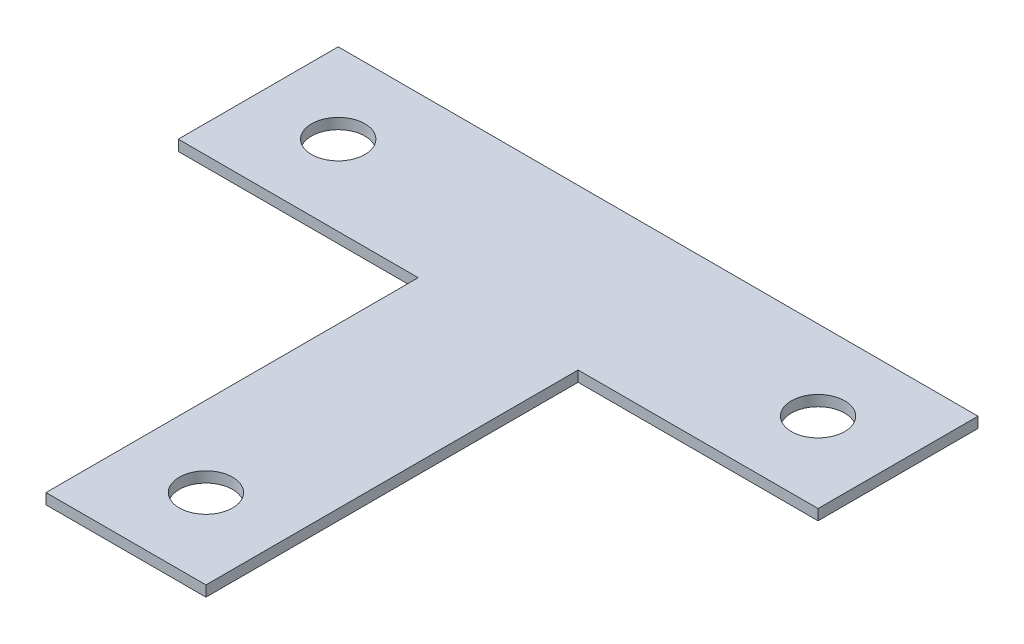
ISO-10303-21;
HEADER;
FILE_DESCRIPTION(('STEP AP214'),'2;1');
FILE_NAME('part.step','',(''),(''),'','','');
FILE_SCHEMA(('AUTOMOTIVE_DESIGN { 1 0 10303 214 1 1 1 1 }'));
ENDSEC;
DATA;
#1=APPLICATION_CONTEXT('core data for automotive mechanical design processes');
#2=APPLICATION_PROTOCOL_DEFINITION('international standard','automotive_design',2000,#1);
#3=PRODUCT_CONTEXT('',#1,'mechanical');
#4=PRODUCT('Part','Part','',(#3));
#5=PRODUCT_RELATED_PRODUCT_CATEGORY('part','',(#4));
#6=PRODUCT_DEFINITION_FORMATION('','',#4);
#7=PRODUCT_DEFINITION_CONTEXT('part definition',#1,'design');
#8=PRODUCT_DEFINITION('design','',#6,#7);
#9=PRODUCT_DEFINITION_SHAPE('','',#8);
#10=(LENGTH_UNIT() NAMED_UNIT(*) SI_UNIT(.MILLI.,.METRE.));
#11=(NAMED_UNIT(*) PLANE_ANGLE_UNIT() SI_UNIT($,.RADIAN.));
#12=(NAMED_UNIT(*) SI_UNIT($,.STERADIAN.) SOLID_ANGLE_UNIT());
#13=UNCERTAINTY_MEASURE_WITH_UNIT(LENGTH_MEASURE(1.E-05),#10,'distance_accuracy_value','');
#14=(GEOMETRIC_REPRESENTATION_CONTEXT(3) GLOBAL_UNCERTAINTY_ASSIGNED_CONTEXT((#13)) GLOBAL_UNIT_ASSIGNED_CONTEXT((#10,
#11,#12)) REPRESENTATION_CONTEXT('',''));
#15=CARTESIAN_POINT('',(0.,0.,0.));
#16=DIRECTION('',(0.,0.,1.));
#17=DIRECTION('',(1.,0.,0.));
#18=AXIS2_PLACEMENT_3D('',#15,#16,#17);
#19=CARTESIAN_POINT('',(0.,2.54,0.));
#20=DIRECTION('',(0.,1.,0.));
#21=DIRECTION('',(0.,0.,1.));
#22=AXIS2_PLACEMENT_3D('',#19,#20,#21);
#23=PLANE('',#22);
#24=CARTESIAN_POINT('',(-57.15,2.54,-44.2080948978361));
#25=DIRECTION('',(0.,1.,0.));
#26=DIRECTION('',(0.,0.,1.));
#27=AXIS2_PLACEMENT_3D('',#24,#25,#26);
#28=CIRCLE('',#27,6.35);
#29=CARTESIAN_POINT('',(-57.15,2.54,-37.8580948978361));
#30=VERTEX_POINT('',#29);
#31=EDGE_CURVE('E182',#30,#30,#28,.T.);
#32=ORIENTED_EDGE('',*,*,#31,.F.);
#33=EDGE_LOOP('',(#32));
#34=FACE_BOUND('',#33,.T.);
#35=DIRECTION('',(1.,0.,0.));
#36=VECTOR('',#35,1.);
#37=CARTESIAN_POINT('',(19.05,2.54,-25.1580948978361));
#38=LINE('',#37,#36);
#39=CARTESIAN_POINT('',(19.05,2.54,-25.1580948978361));
#40=VERTEX_POINT('',#39);
#41=CARTESIAN_POINT('',(76.2,2.54,-25.1580948978361));
#42=VERTEX_POINT('',#41);
#43=EDGE_CURVE('E145',#40,#42,#38,.T.);
#44=ORIENTED_EDGE('',*,*,#43,.T.);
#45=DIRECTION('',(0.,0.,-1.));
#46=VECTOR('',#45,1.);
#47=CARTESIAN_POINT('',(76.2,2.54,-25.1580948978361));
#48=LINE('',#47,#46);
#49=CARTESIAN_POINT('',(76.2,2.54,-63.2580948978361));
#50=VERTEX_POINT('',#49);
#51=EDGE_CURVE('E93',#42,#50,#48,.T.);
#52=ORIENTED_EDGE('',*,*,#51,.T.);
#53=DIRECTION('',(-1.,0.,0.));
#54=VECTOR('',#53,1.);
#55=CARTESIAN_POINT('',(76.2,2.54,-63.2580948978361));
#56=LINE('',#55,#54);
#57=CARTESIAN_POINT('',(-76.2,2.54,-63.2580948978361));
#58=VERTEX_POINT('',#57);
#59=EDGE_CURVE('E160',#50,#58,#56,.T.);
#60=ORIENTED_EDGE('',*,*,#59,.T.);
#61=DIRECTION('',(0.,0.,1.));
#62=VECTOR('',#61,1.);
#63=CARTESIAN_POINT('',(-76.2,2.54,-63.2580948978361));
#64=LINE('',#63,#62);
#65=CARTESIAN_POINT('',(-76.2,2.54,-25.1580948978361));
#66=VERTEX_POINT('',#65);
#67=EDGE_CURVE('E173',#58,#66,#64,.T.);
#68=ORIENTED_EDGE('',*,*,#67,.T.);
#69=DIRECTION('',(1.,0.,0.));
#70=VECTOR('',#69,1.);
#71=CARTESIAN_POINT('',(-76.2,2.54,-25.1580948978361));
#72=LINE('',#71,#70);
#73=CARTESIAN_POINT('',(-19.05,2.54,-25.1580948978361));
#74=VERTEX_POINT('',#73);
#75=EDGE_CURVE('E112',#66,#74,#72,.T.);
#76=ORIENTED_EDGE('',*,*,#75,.T.);
#77=DIRECTION('',(0.,0.,1.));
#78=VECTOR('',#77,1.);
#79=CARTESIAN_POINT('',(-19.05,2.54,-25.1580948978361));
#80=LINE('',#79,#78);
#81=CARTESIAN_POINT('',(-19.05,2.54,63.5));
#82=VERTEX_POINT('',#81);
#83=EDGE_CURVE('E106',#74,#82,#80,.T.);
#84=ORIENTED_EDGE('',*,*,#83,.T.);
#85=DIRECTION('',(1.,0.,0.));
#86=VECTOR('',#85,1.);
#87=CARTESIAN_POINT('',(-19.05,2.54,63.5));
#88=LINE('',#87,#86);
#89=CARTESIAN_POINT('',(19.05,2.54,63.5));
#90=VERTEX_POINT('',#89);
#91=EDGE_CURVE('E110',#82,#90,#88,.T.);
#92=ORIENTED_EDGE('',*,*,#91,.T.);
#93=DIRECTION('',(0.,0.,-1.));
#94=VECTOR('',#93,1.);
#95=CARTESIAN_POINT('',(19.05,2.54,63.5));
#96=LINE('',#95,#94);
#97=EDGE_CURVE('E50',#90,#40,#96,.T.);
#98=ORIENTED_EDGE('',*,*,#97,.T.);
#99=EDGE_LOOP('',(#44,#52,#60,#68,#76,#84,#92,#98));
#100=FACE_BOUND('',#99,.T.);
#101=CARTESIAN_POINT('',(0.,2.54,44.45));
#102=DIRECTION('',(0.,1.,0.));
#103=DIRECTION('',(0.,0.,1.));
#104=AXIS2_PLACEMENT_3D('',#101,#102,#103);
#105=CIRCLE('',#104,6.35);
#106=CARTESIAN_POINT('',(0.,2.54,50.8));
#107=VERTEX_POINT('',#106);
#108=EDGE_CURVE('E134',#107,#107,#105,.T.);
#109=ORIENTED_EDGE('',*,*,#108,.F.);
#110=EDGE_LOOP('',(#109));
#111=FACE_BOUND('',#110,.T.);
#112=CARTESIAN_POINT('',(57.15,2.54,-44.2080948978361));
#113=DIRECTION('',(0.,1.,0.));
#114=DIRECTION('',(0.,0.,1.));
#115=AXIS2_PLACEMENT_3D('',#112,#113,#114);
#116=CIRCLE('',#115,6.35);
#117=CARTESIAN_POINT('',(57.15,2.54,-37.8580948978361));
#118=VERTEX_POINT('',#117);
#119=EDGE_CURVE('E188',#118,#118,#116,.T.);
#120=ORIENTED_EDGE('',*,*,#119,.F.);
#121=EDGE_LOOP('',(#120));
#122=FACE_BOUND('',#121,.T.);
#123=ADVANCED_FACE('F33',(#34,#100,#111,#122),#23,.T.);
#124=CARTESIAN_POINT('',(0.,0.,0.));
#125=DIRECTION('',(0.,1.,0.));
#126=DIRECTION('',(0.,0.,1.));
#127=AXIS2_PLACEMENT_3D('',#124,#125,#126);
#128=PLANE('',#127);
#129=DIRECTION('',(1.,0.,0.));
#130=VECTOR('',#129,1.);
#131=CARTESIAN_POINT('',(19.05,0.,-25.1580948978361));
#132=LINE('',#131,#130);
#133=CARTESIAN_POINT('',(19.05,0.,-25.1580948978361));
#134=VERTEX_POINT('',#133);
#135=CARTESIAN_POINT('',(76.2,0.,-25.1580948978361));
#136=VERTEX_POINT('',#135);
#137=EDGE_CURVE('E130',#134,#136,#132,.T.);
#138=ORIENTED_EDGE('',*,*,#137,.F.);
#139=DIRECTION('',(0.,0.,-1.));
#140=VECTOR('',#139,1.);
#141=CARTESIAN_POINT('',(19.05,0.,63.5));
#142=LINE('',#141,#140);
#143=CARTESIAN_POINT('',(19.05,0.,63.5));
#144=VERTEX_POINT('',#143);
#145=EDGE_CURVE('E85',#144,#134,#142,.T.);
#146=ORIENTED_EDGE('',*,*,#145,.F.);
#147=DIRECTION('',(1.,0.,0.));
#148=VECTOR('',#147,1.);
#149=CARTESIAN_POINT('',(-19.05,0.,63.5));
#150=LINE('',#149,#148);
#151=CARTESIAN_POINT('',(-19.05,0.,63.5));
#152=VERTEX_POINT('',#151);
#153=EDGE_CURVE('E79',#152,#144,#150,.T.);
#154=ORIENTED_EDGE('',*,*,#153,.F.);
#155=DIRECTION('',(0.,0.,1.));
#156=VECTOR('',#155,1.);
#157=CARTESIAN_POINT('',(-19.05,0.,-25.1580948978361));
#158=LINE('',#157,#156);
#159=CARTESIAN_POINT('',(-19.05,0.,-25.1580948978361));
#160=VERTEX_POINT('',#159);
#161=EDGE_CURVE('E120',#160,#152,#158,.T.);
#162=ORIENTED_EDGE('',*,*,#161,.F.);
#163=DIRECTION('',(1.,0.,0.));
#164=VECTOR('',#163,1.);
#165=CARTESIAN_POINT('',(-76.2,0.,-25.1580948978361));
#166=LINE('',#165,#164);
#167=CARTESIAN_POINT('',(-76.2,0.,-25.1580948978361));
#168=VERTEX_POINT('',#167);
#169=EDGE_CURVE('E140',#168,#160,#166,.T.);
#170=ORIENTED_EDGE('',*,*,#169,.F.);
#171=DIRECTION('',(0.,0.,1.));
#172=VECTOR('',#171,1.);
#173=CARTESIAN_POINT('',(-76.2,0.,-63.2580948978361));
#174=LINE('',#173,#172);
#175=CARTESIAN_POINT('',(-76.2,0.,-63.2580948978361));
#176=VERTEX_POINT('',#175);
#177=EDGE_CURVE('E138',#176,#168,#174,.T.);
#178=ORIENTED_EDGE('',*,*,#177,.F.);
#179=DIRECTION('',(-1.,0.,0.));
#180=VECTOR('',#179,1.);
#181=CARTESIAN_POINT('',(76.2,0.,-63.2580948978361));
#182=LINE('',#181,#180);
#183=CARTESIAN_POINT('',(76.2,0.,-63.2580948978361));
#184=VERTEX_POINT('',#183);
#185=EDGE_CURVE('E136',#184,#176,#182,.T.);
#186=ORIENTED_EDGE('',*,*,#185,.F.);
#187=DIRECTION('',(0.,0.,-1.));
#188=VECTOR('',#187,1.);
#189=CARTESIAN_POINT('',(76.2,0.,-25.1580948978361));
#190=LINE('',#189,#188);
#191=EDGE_CURVE('E133',#136,#184,#190,.T.);
#192=ORIENTED_EDGE('',*,*,#191,.F.);
#193=EDGE_LOOP('',(#138,#146,#154,#162,#170,#178,#186,#192));
#194=FACE_BOUND('',#193,.T.);
#195=CARTESIAN_POINT('',(0.,0.,44.45));
#196=DIRECTION('',(0.,1.,0.));
#197=DIRECTION('',(0.,0.,1.));
#198=AXIS2_PLACEMENT_3D('',#195,#196,#197);
#199=CIRCLE('',#198,6.35);
#200=CARTESIAN_POINT('',(0.,0.,50.8));
#201=VERTEX_POINT('',#200);
#202=EDGE_CURVE('E179',#201,#201,#199,.T.);
#203=ORIENTED_EDGE('',*,*,#202,.T.);
#204=EDGE_LOOP('',(#203));
#205=FACE_BOUND('',#204,.T.);
#206=CARTESIAN_POINT('',(-57.15,0.,-44.2080948978361));
#207=DIRECTION('',(0.,1.,0.));
#208=DIRECTION('',(0.,0.,1.));
#209=AXIS2_PLACEMENT_3D('',#206,#207,#208);
#210=CIRCLE('',#209,6.35);
#211=CARTESIAN_POINT('',(-57.15,0.,-37.8580948978361));
#212=VERTEX_POINT('',#211);
#213=EDGE_CURVE('E185',#212,#212,#210,.T.);
#214=ORIENTED_EDGE('',*,*,#213,.T.);
#215=EDGE_LOOP('',(#214));
#216=FACE_BOUND('',#215,.T.);
#217=CARTESIAN_POINT('',(57.15,0.,-44.2080948978361));
#218=DIRECTION('',(0.,1.,0.));
#219=DIRECTION('',(0.,0.,1.));
#220=AXIS2_PLACEMENT_3D('',#217,#218,#219);
#221=CIRCLE('',#220,6.35);
#222=CARTESIAN_POINT('',(57.15,0.,-37.8580948978361));
#223=VERTEX_POINT('',#222);
#224=EDGE_CURVE('E191',#223,#223,#221,.T.);
#225=ORIENTED_EDGE('',*,*,#224,.T.);
#226=EDGE_LOOP('',(#225));
#227=FACE_BOUND('',#226,.T.);
#228=ADVANCED_FACE('F164',(#194,#205,#216,#227),#128,.F.);
#229=CARTESIAN_POINT('',(19.05,2.54,-25.1580948978361));
#230=DIRECTION('',(0.,0.,-1.));
#231=DIRECTION('',(-1.,0.,0.));
#232=AXIS2_PLACEMENT_3D('',#229,#230,#231);
#233=PLANE('',#232);
#234=ORIENTED_EDGE('',*,*,#137,.T.);
#235=DIRECTION('',(0.,-1.,0.));
#236=VECTOR('',#235,1.);
#237=CARTESIAN_POINT('',(76.2,2.54,-25.1580948978361));
#238=LINE('',#237,#236);
#239=EDGE_CURVE('E11',#42,#136,#238,.T.);
#240=ORIENTED_EDGE('',*,*,#239,.F.);
#241=ORIENTED_EDGE('',*,*,#43,.F.);
#242=DIRECTION('',(0.,-1.,0.));
#243=VECTOR('',#242,1.);
#244=CARTESIAN_POINT('',(19.05,2.54,-25.1580948978361));
#245=LINE('',#244,#243);
#246=EDGE_CURVE('E126',#40,#134,#245,.T.);
#247=ORIENTED_EDGE('',*,*,#246,.T.);
#248=EDGE_LOOP('',(#234,#240,#241,#247));
#249=FACE_BOUND('',#248,.T.);
#250=ADVANCED_FACE('F35',(#249),#233,.F.);
#251=CARTESIAN_POINT('',(76.2,2.54,-25.1580948978361));
#252=DIRECTION('',(-1.,0.,0.));
#253=DIRECTION('',(0.,0.,1.));
#254=AXIS2_PLACEMENT_3D('',#251,#252,#253);
#255=PLANE('',#254);
#256=ORIENTED_EDGE('',*,*,#191,.T.);
#257=DIRECTION('',(0.,-1.,0.));
#258=VECTOR('',#257,1.);
#259=CARTESIAN_POINT('',(76.2,2.54,-63.2580948978361));
#260=LINE('',#259,#258);
#261=EDGE_CURVE('E42',#50,#184,#260,.T.);
#262=ORIENTED_EDGE('',*,*,#261,.F.);
#263=ORIENTED_EDGE('',*,*,#51,.F.);
#264=ORIENTED_EDGE('',*,*,#239,.T.);
#265=EDGE_LOOP('',(#256,#262,#263,#264));
#266=FACE_BOUND('',#265,.T.);
#267=ADVANCED_FACE('F224',(#266),#255,.F.);
#268=CARTESIAN_POINT('',(76.2,2.54,-63.2580948978361));
#269=DIRECTION('',(0.,0.,1.));
#270=DIRECTION('',(1.,0.,0.));
#271=AXIS2_PLACEMENT_3D('',#268,#269,#270);
#272=PLANE('',#271);
#273=ORIENTED_EDGE('',*,*,#185,.T.);
#274=DIRECTION('',(0.,-1.,0.));
#275=VECTOR('',#274,1.);
#276=CARTESIAN_POINT('',(-76.2,2.54,-63.2580948978361));
#277=LINE('',#276,#275);
#278=EDGE_CURVE('E152',#58,#176,#277,.T.);
#279=ORIENTED_EDGE('',*,*,#278,.F.);
#280=ORIENTED_EDGE('',*,*,#59,.F.);
#281=ORIENTED_EDGE('',*,*,#261,.T.);
#282=EDGE_LOOP('',(#273,#279,#280,#281));
#283=FACE_BOUND('',#282,.T.);
#284=ADVANCED_FACE('F158',(#283),#272,.F.);
#285=CARTESIAN_POINT('',(-76.2,2.54,-63.2580948978361));
#286=DIRECTION('',(1.,0.,0.));
#287=DIRECTION('',(0.,0.,-1.));
#288=AXIS2_PLACEMENT_3D('',#285,#286,#287);
#289=PLANE('',#288);
#290=ORIENTED_EDGE('',*,*,#177,.T.);
#291=DIRECTION('',(0.,-1.,0.));
#292=VECTOR('',#291,1.);
#293=CARTESIAN_POINT('',(-76.2,2.54,-25.1580948978361));
#294=LINE('',#293,#292);
#295=EDGE_CURVE('E149',#66,#168,#294,.T.);
#296=ORIENTED_EDGE('',*,*,#295,.F.);
#297=ORIENTED_EDGE('',*,*,#67,.F.);
#298=ORIENTED_EDGE('',*,*,#278,.T.);
#299=EDGE_LOOP('',(#290,#296,#297,#298));
#300=FACE_BOUND('',#299,.T.);
#301=ADVANCED_FACE('F169',(#300),#289,.F.);
#302=CARTESIAN_POINT('',(-76.2,2.54,-25.1580948978361));
#303=DIRECTION('',(0.,0.,-1.));
#304=DIRECTION('',(-1.,0.,0.));
#305=AXIS2_PLACEMENT_3D('',#302,#303,#304);
#306=PLANE('',#305);
#307=ORIENTED_EDGE('',*,*,#169,.T.);
#308=DIRECTION('',(0.,-1.,0.));
#309=VECTOR('',#308,1.);
#310=CARTESIAN_POINT('',(-19.05,2.54,-25.1580948978361));
#311=LINE('',#310,#309);
#312=EDGE_CURVE('E121',#74,#160,#311,.T.);
#313=ORIENTED_EDGE('',*,*,#312,.F.);
#314=ORIENTED_EDGE('',*,*,#75,.F.);
#315=ORIENTED_EDGE('',*,*,#295,.T.);
#316=EDGE_LOOP('',(#307,#313,#314,#315));
#317=FACE_BOUND('',#316,.T.);
#318=ADVANCED_FACE('F172',(#317),#306,.F.);
#319=CARTESIAN_POINT('',(-19.05,2.54,-25.1580948978361));
#320=DIRECTION('',(1.,0.,0.));
#321=DIRECTION('',(0.,0.,-1.));
#322=AXIS2_PLACEMENT_3D('',#319,#320,#321);
#323=PLANE('',#322);
#324=ORIENTED_EDGE('',*,*,#161,.T.);
#325=DIRECTION('',(0.,-1.,0.));
#326=VECTOR('',#325,1.);
#327=CARTESIAN_POINT('',(-19.05,2.54,63.5));
#328=LINE('',#327,#326);
#329=EDGE_CURVE('E117',#82,#152,#328,.T.);
#330=ORIENTED_EDGE('',*,*,#329,.F.);
#331=ORIENTED_EDGE('',*,*,#83,.F.);
#332=ORIENTED_EDGE('',*,*,#312,.T.);
#333=EDGE_LOOP('',(#324,#330,#331,#332));
#334=FACE_BOUND('',#333,.T.);
#335=ADVANCED_FACE('F118',(#334),#323,.F.);
#336=CARTESIAN_POINT('',(-19.05,2.54,63.5));
#337=DIRECTION('',(0.,0.,-1.));
#338=DIRECTION('',(-1.,0.,0.));
#339=AXIS2_PLACEMENT_3D('',#336,#337,#338);
#340=PLANE('',#339);
#341=ORIENTED_EDGE('',*,*,#153,.T.);
#342=DIRECTION('',(0.,-1.,0.));
#343=VECTOR('',#342,1.);
#344=CARTESIAN_POINT('',(19.05,2.54,63.5));
#345=LINE('',#344,#343);
#346=EDGE_CURVE('E122',#90,#144,#345,.T.);
#347=ORIENTED_EDGE('',*,*,#346,.F.);
#348=ORIENTED_EDGE('',*,*,#91,.F.);
#349=ORIENTED_EDGE('',*,*,#329,.T.);
#350=EDGE_LOOP('',(#341,#347,#348,#349));
#351=FACE_BOUND('',#350,.T.);
#352=ADVANCED_FACE('F124',(#351),#340,.F.);
#353=CARTESIAN_POINT('',(19.05,2.54,63.5));
#354=DIRECTION('',(-1.,0.,0.));
#355=DIRECTION('',(0.,0.,1.));
#356=AXIS2_PLACEMENT_3D('',#353,#354,#355);
#357=PLANE('',#356);
#358=ORIENTED_EDGE('',*,*,#145,.T.);
#359=ORIENTED_EDGE('',*,*,#246,.F.);
#360=ORIENTED_EDGE('',*,*,#97,.F.);
#361=ORIENTED_EDGE('',*,*,#346,.T.);
#362=EDGE_LOOP('',(#358,#359,#360,#361));
#363=FACE_BOUND('',#362,.T.);
#364=ADVANCED_FACE('F212',(#363),#357,.F.);
#365=CARTESIAN_POINT('',(0.,2.54,44.45));
#366=DIRECTION('',(0.,-1.,0.));
#367=DIRECTION('',(0.,0.,-1.));
#368=AXIS2_PLACEMENT_3D('',#365,#366,#367);
#369=CYLINDRICAL_SURFACE('',#368,6.35);
#370=ORIENTED_EDGE('',*,*,#108,.T.);
#371=EDGE_LOOP('',(#370));
#372=FACE_BOUND('',#371,.T.);
#373=ORIENTED_EDGE('',*,*,#202,.F.);
#374=EDGE_LOOP('',(#373));
#375=FACE_BOUND('',#374,.T.);
#376=ADVANCED_FACE('F209',(#372,#375),#369,.F.);
#377=CARTESIAN_POINT('',(-57.15,2.54,-44.2080948978361));
#378=DIRECTION('',(0.,-1.,0.));
#379=DIRECTION('',(0.,0.,-1.));
#380=AXIS2_PLACEMENT_3D('',#377,#378,#379);
#381=CYLINDRICAL_SURFACE('',#380,6.35);
#382=ORIENTED_EDGE('',*,*,#31,.T.);
#383=EDGE_LOOP('',(#382));
#384=FACE_BOUND('',#383,.T.);
#385=ORIENTED_EDGE('',*,*,#213,.F.);
#386=EDGE_LOOP('',(#385));
#387=FACE_BOUND('',#386,.T.);
#388=ADVANCED_FACE('F288',(#384,#387),#381,.F.);
#389=CARTESIAN_POINT('',(57.15,2.54,-44.2080948978361));
#390=DIRECTION('',(0.,-1.,0.));
#391=DIRECTION('',(0.,0.,-1.));
#392=AXIS2_PLACEMENT_3D('',#389,#390,#391);
#393=CYLINDRICAL_SURFACE('',#392,6.35);
#394=ORIENTED_EDGE('',*,*,#119,.T.);
#395=EDGE_LOOP('',(#394));
#396=FACE_BOUND('',#395,.T.);
#397=ORIENTED_EDGE('',*,*,#224,.F.);
#398=EDGE_LOOP('',(#397));
#399=FACE_BOUND('',#398,.T.);
#400=ADVANCED_FACE('F197',(#396,#399),#393,.F.);
#401=CLOSED_SHELL('',(#123,#228,#250,#267,#284,#301,#318,#335,#352,#364,#376,#388,#400));
#402=MANIFOLD_SOLID_BREP('B2',#401);
#403=ADVANCED_BREP_SHAPE_REPRESENTATION('',(#18,#402),#14);
#404=SHAPE_DEFINITION_REPRESENTATION(#9,#403);
ENDSEC;
END-ISO-10303-21;
